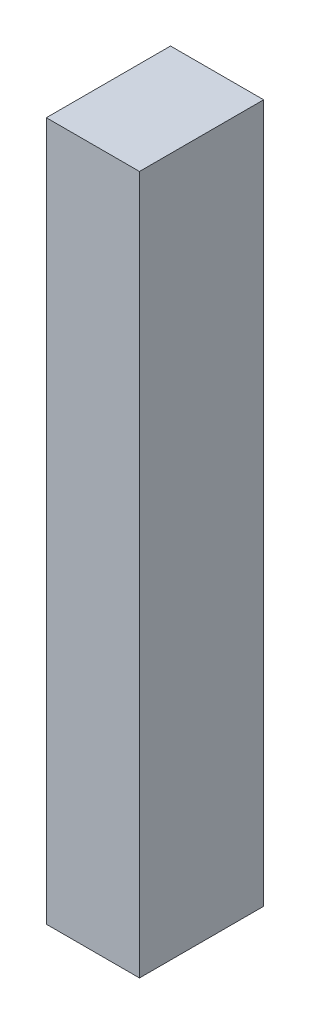
ISO-10303-21;
HEADER;
FILE_DESCRIPTION(('STEP AP214'),'2;1');
FILE_NAME('part.step','',(''),(''),'','','');
FILE_SCHEMA(('AUTOMOTIVE_DESIGN { 1 0 10303 214 1 1 1 1 }'));
ENDSEC;
DATA;
#1=APPLICATION_CONTEXT('core data for automotive mechanical design processes');
#2=APPLICATION_PROTOCOL_DEFINITION('international standard','automotive_design',2000,#1);
#3=PRODUCT_CONTEXT('',#1,'mechanical');
#4=PRODUCT('Part','Part','',(#3));
#5=PRODUCT_RELATED_PRODUCT_CATEGORY('part','',(#4));
#6=PRODUCT_DEFINITION_FORMATION('','',#4);
#7=PRODUCT_DEFINITION_CONTEXT('part definition',#1,'design');
#8=PRODUCT_DEFINITION('design','',#6,#7);
#9=PRODUCT_DEFINITION_SHAPE('','',#8);
#10=(LENGTH_UNIT() NAMED_UNIT(*) SI_UNIT(.MILLI.,.METRE.));
#11=(NAMED_UNIT(*) PLANE_ANGLE_UNIT() SI_UNIT($,.RADIAN.));
#12=(NAMED_UNIT(*) SI_UNIT($,.STERADIAN.) SOLID_ANGLE_UNIT());
#13=UNCERTAINTY_MEASURE_WITH_UNIT(LENGTH_MEASURE(1.E-05),#10,'distance_accuracy_value','');
#14=(GEOMETRIC_REPRESENTATION_CONTEXT(3) GLOBAL_UNCERTAINTY_ASSIGNED_CONTEXT((#13)) GLOBAL_UNIT_ASSIGNED_CONTEXT((#10,
#11,#12)) REPRESENTATION_CONTEXT('',''));
#15=CARTESIAN_POINT('',(0.,0.,0.));
#16=DIRECTION('',(0.,0.,1.));
#17=DIRECTION('',(1.,0.,0.));
#18=AXIS2_PLACEMENT_3D('',#15,#16,#17);
#19=CARTESIAN_POINT('',(3.,45.,-4.));
#20=DIRECTION('',(-1.,0.,0.));
#21=DIRECTION('',(0.,0.,1.));
#22=AXIS2_PLACEMENT_3D('',#19,#20,#21);
#23=PLANE('',#22);
#24=DIRECTION('',(0.,0.,-1.));
#25=VECTOR('',#24,1.);
#26=CARTESIAN_POINT('',(3.,0.,-4.));
#27=LINE('',#26,#25);
#28=CARTESIAN_POINT('',(3.,0.,4.));
#29=VERTEX_POINT('',#28);
#30=CARTESIAN_POINT('',(3.,0.,-4.));
#31=VERTEX_POINT('',#30);
#32=EDGE_CURVE('E97',#29,#31,#27,.T.);
#33=ORIENTED_EDGE('',*,*,#32,.T.);
#34=DIRECTION('',(0.,-1.,0.));
#35=VECTOR('',#34,1.);
#36=CARTESIAN_POINT('',(3.,45.,-4.));
#37=LINE('',#36,#35);
#38=CARTESIAN_POINT('',(3.,45.,-4.));
#39=VERTEX_POINT('',#38);
#40=EDGE_CURVE('E11',#39,#31,#37,.T.);
#41=ORIENTED_EDGE('',*,*,#40,.F.);
#42=DIRECTION('',(0.,0.,-1.));
#43=VECTOR('',#42,1.);
#44=CARTESIAN_POINT('',(3.,45.,-4.));
#45=LINE('',#44,#43);
#46=CARTESIAN_POINT('',(3.,45.,4.));
#47=VERTEX_POINT('',#46);
#48=EDGE_CURVE('E85',#47,#39,#45,.T.);
#49=ORIENTED_EDGE('',*,*,#48,.F.);
#50=DIRECTION('',(0.,-1.,0.));
#51=VECTOR('',#50,1.);
#52=CARTESIAN_POINT('',(3.,45.,4.));
#53=LINE('',#52,#51);
#54=EDGE_CURVE('E93',#47,#29,#53,.T.);
#55=ORIENTED_EDGE('',*,*,#54,.T.);
#56=EDGE_LOOP('',(#33,#41,#49,#55));
#57=FACE_BOUND('',#56,.T.);
#58=ADVANCED_FACE('F34',(#57),#23,.F.);
#59=CARTESIAN_POINT('',(-3.,45.,-4.));
#60=DIRECTION('',(0.,0.,1.));
#61=DIRECTION('',(1.,0.,0.));
#62=AXIS2_PLACEMENT_3D('',#59,#60,#61);
#63=PLANE('',#62);
#64=DIRECTION('',(-1.,0.,0.));
#65=VECTOR('',#64,1.);
#66=CARTESIAN_POINT('',(-3.,0.,-4.));
#67=LINE('',#66,#65);
#68=CARTESIAN_POINT('',(-3.,0.,-4.));
#69=VERTEX_POINT('',#68);
#70=EDGE_CURVE('E89',#31,#69,#67,.T.);
#71=ORIENTED_EDGE('',*,*,#70,.T.);
#72=DIRECTION('',(0.,-1.,0.));
#73=VECTOR('',#72,1.);
#74=CARTESIAN_POINT('',(-3.,45.,-4.));
#75=LINE('',#74,#73);
#76=CARTESIAN_POINT('',(-3.,45.,-4.));
#77=VERTEX_POINT('',#76);
#78=EDGE_CURVE('E42',#77,#69,#75,.T.);
#79=ORIENTED_EDGE('',*,*,#78,.F.);
#80=DIRECTION('',(-1.,0.,0.));
#81=VECTOR('',#80,1.);
#82=CARTESIAN_POINT('',(-3.,45.,-4.));
#83=LINE('',#82,#81);
#84=EDGE_CURVE('E80',#39,#77,#83,.T.);
#85=ORIENTED_EDGE('',*,*,#84,.F.);
#86=ORIENTED_EDGE('',*,*,#40,.T.);
#87=EDGE_LOOP('',(#71,#79,#85,#86));
#88=FACE_BOUND('',#87,.T.);
#89=ADVANCED_FACE('F88',(#88),#63,.F.);
#90=CARTESIAN_POINT('',(-3.,45.,-4.));
#91=DIRECTION('',(1.,0.,0.));
#92=DIRECTION('',(0.,0.,-1.));
#93=AXIS2_PLACEMENT_3D('',#90,#91,#92);
#94=PLANE('',#93);
#95=DIRECTION('',(0.,0.,1.));
#96=VECTOR('',#95,1.);
#97=CARTESIAN_POINT('',(-3.,0.,-4.));
#98=LINE('',#97,#96);
#99=CARTESIAN_POINT('',(-3.,0.,4.));
#100=VERTEX_POINT('',#99);
#101=EDGE_CURVE('E67',#69,#100,#98,.T.);
#102=ORIENTED_EDGE('',*,*,#101,.T.);
#103=DIRECTION('',(0.,-1.,0.));
#104=VECTOR('',#103,1.);
#105=CARTESIAN_POINT('',(-3.,45.,4.));
#106=LINE('',#105,#104);
#107=CARTESIAN_POINT('',(-3.,45.,4.));
#108=VERTEX_POINT('',#107);
#109=EDGE_CURVE('E90',#108,#100,#106,.T.);
#110=ORIENTED_EDGE('',*,*,#109,.F.);
#111=DIRECTION('',(0.,0.,1.));
#112=VECTOR('',#111,1.);
#113=CARTESIAN_POINT('',(-3.,45.,-4.));
#114=LINE('',#113,#112);
#115=EDGE_CURVE('E83',#77,#108,#114,.T.);
#116=ORIENTED_EDGE('',*,*,#115,.F.);
#117=ORIENTED_EDGE('',*,*,#78,.T.);
#118=EDGE_LOOP('',(#102,#110,#116,#117));
#119=FACE_BOUND('',#118,.T.);
#120=ADVANCED_FACE('F91',(#119),#94,.F.);
#121=CARTESIAN_POINT('',(-3.,45.,4.));
#122=DIRECTION('',(0.,0.,-1.));
#123=DIRECTION('',(-1.,0.,0.));
#124=AXIS2_PLACEMENT_3D('',#121,#122,#123);
#125=PLANE('',#124);
#126=DIRECTION('',(1.,0.,0.));
#127=VECTOR('',#126,1.);
#128=CARTESIAN_POINT('',(-3.,0.,4.));
#129=LINE('',#128,#127);
#130=EDGE_CURVE('E73',#100,#29,#129,.T.);
#131=ORIENTED_EDGE('',*,*,#130,.T.);
#132=ORIENTED_EDGE('',*,*,#54,.F.);
#133=DIRECTION('',(1.,0.,0.));
#134=VECTOR('',#133,1.);
#135=CARTESIAN_POINT('',(-3.,45.,4.));
#136=LINE('',#135,#134);
#137=EDGE_CURVE('E50',#108,#47,#136,.T.);
#138=ORIENTED_EDGE('',*,*,#137,.F.);
#139=ORIENTED_EDGE('',*,*,#109,.T.);
#140=EDGE_LOOP('',(#131,#132,#138,#139));
#141=FACE_BOUND('',#140,.T.);
#142=ADVANCED_FACE('F104',(#141),#125,.F.);
#143=CARTESIAN_POINT('',(0.,45.,0.));
#144=DIRECTION('',(0.,1.,0.));
#145=DIRECTION('',(0.,0.,1.));
#146=AXIS2_PLACEMENT_3D('',#143,#144,#145);
#147=PLANE('',#146);
#148=ORIENTED_EDGE('',*,*,#48,.T.);
#149=ORIENTED_EDGE('',*,*,#84,.T.);
#150=ORIENTED_EDGE('',*,*,#115,.T.);
#151=ORIENTED_EDGE('',*,*,#137,.T.);
#152=EDGE_LOOP('',(#148,#149,#150,#151));
#153=FACE_BOUND('',#152,.T.);
#154=ADVANCED_FACE('F81',(#153),#147,.T.);
#155=CARTESIAN_POINT('',(0.,0.,0.));
#156=DIRECTION('',(0.,1.,0.));
#157=DIRECTION('',(0.,0.,1.));
#158=AXIS2_PLACEMENT_3D('',#155,#156,#157);
#159=PLANE('',#158);
#160=ORIENTED_EDGE('',*,*,#32,.F.);
#161=ORIENTED_EDGE('',*,*,#130,.F.);
#162=ORIENTED_EDGE('',*,*,#101,.F.);
#163=ORIENTED_EDGE('',*,*,#70,.F.);
#164=EDGE_LOOP('',(#160,#161,#162,#163));
#165=FACE_BOUND('',#164,.T.);
#166=ADVANCED_FACE('F107',(#165),#159,.F.);
#167=CLOSED_SHELL('',(#58,#89,#120,#142,#154,#166));
#168=MANIFOLD_SOLID_BREP('B2',#167);
#169=ADVANCED_BREP_SHAPE_REPRESENTATION('',(#18,#168),#14);
#170=SHAPE_DEFINITION_REPRESENTATION(#9,#169);
ENDSEC;
END-ISO-10303-21;
